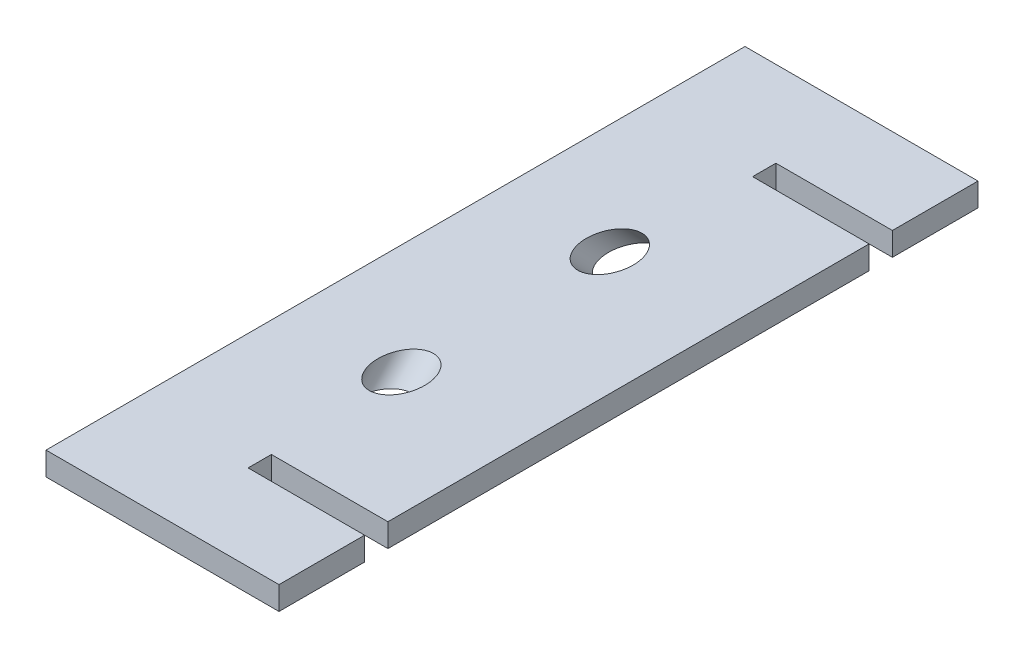
ISO-10303-21;
HEADER;
FILE_DESCRIPTION(('STEP AP214'),'2;1');
FILE_NAME('part.step','',(''),(''),'','','');
FILE_SCHEMA(('AUTOMOTIVE_DESIGN { 1 0 10303 214 1 1 1 1 }'));
ENDSEC;
DATA;
#1=APPLICATION_CONTEXT('core data for automotive mechanical design processes');
#2=APPLICATION_PROTOCOL_DEFINITION('international standard','automotive_design',2000,#1);
#3=PRODUCT_CONTEXT('',#1,'mechanical');
#4=PRODUCT('Part','Part','',(#3));
#5=PRODUCT_RELATED_PRODUCT_CATEGORY('part','',(#4));
#6=PRODUCT_DEFINITION_FORMATION('','',#4);
#7=PRODUCT_DEFINITION_CONTEXT('part definition',#1,'design');
#8=PRODUCT_DEFINITION('design','',#6,#7);
#9=PRODUCT_DEFINITION_SHAPE('','',#8);
#10=(LENGTH_UNIT() NAMED_UNIT(*) SI_UNIT(.MILLI.,.METRE.));
#11=(NAMED_UNIT(*) PLANE_ANGLE_UNIT() SI_UNIT($,.RADIAN.));
#12=(NAMED_UNIT(*) SI_UNIT($,.STERADIAN.) SOLID_ANGLE_UNIT());
#13=UNCERTAINTY_MEASURE_WITH_UNIT(LENGTH_MEASURE(1.E-05),#10,'distance_accuracy_value','');
#14=(GEOMETRIC_REPRESENTATION_CONTEXT(3) GLOBAL_UNCERTAINTY_ASSIGNED_CONTEXT((#13)) GLOBAL_UNIT_ASSIGNED_CONTEXT((#10,
#11,#12)) REPRESENTATION_CONTEXT('',''));
#15=CARTESIAN_POINT('',(0.,0.,0.));
#16=DIRECTION('',(0.,0.,1.));
#17=DIRECTION('',(1.,0.,0.));
#18=AXIS2_PLACEMENT_3D('',#15,#16,#17);
#19=CARTESIAN_POINT('',(2540.,217.4,-190.5));
#20=DIRECTION('',(-1.,0.,0.));
#21=DIRECTION('',(0.,0.,1.));
#22=AXIS2_PLACEMENT_3D('',#19,#20,#21);
#23=PLANE('',#22);
#24=DIRECTION('',(0.,0.,1.));
#25=VECTOR('',#24,1.);
#26=CARTESIAN_POINT('',(2540.,230.1,-190.5));
#27=LINE('',#26,#25);
#28=CARTESIAN_POINT('',(2540.,230.1,-190.5));
#29=VERTEX_POINT('',#28);
#30=CARTESIAN_POINT('',(2540.,230.1,190.5));
#31=VERTEX_POINT('',#30);
#32=EDGE_CURVE('E122',#29,#31,#27,.T.);
#33=ORIENTED_EDGE('',*,*,#32,.F.);
#34=DIRECTION('',(0.,1.,0.));
#35=VECTOR('',#34,1.);
#36=CARTESIAN_POINT('',(2540.,217.4,-190.5));
#37=LINE('',#36,#35);
#38=CARTESIAN_POINT('',(2540.,217.4,-190.5));
#39=VERTEX_POINT('',#38);
#40=EDGE_CURVE('E117',#39,#29,#37,.T.);
#41=ORIENTED_EDGE('',*,*,#40,.F.);
#42=DIRECTION('',(0.,0.,1.));
#43=VECTOR('',#42,1.);
#44=CARTESIAN_POINT('',(2540.,217.4,-190.5));
#45=LINE('',#44,#43);
#46=CARTESIAN_POINT('',(2540.,217.4,190.5));
#47=VERTEX_POINT('',#46);
#48=EDGE_CURVE('E124',#39,#47,#45,.T.);
#49=ORIENTED_EDGE('',*,*,#48,.T.);
#50=DIRECTION('',(0.,1.,0.));
#51=VECTOR('',#50,1.);
#52=CARTESIAN_POINT('',(2540.,217.4,190.5));
#53=LINE('',#52,#51);
#54=EDGE_CURVE('E120',#47,#31,#53,.T.);
#55=ORIENTED_EDGE('',*,*,#54,.T.);
#56=EDGE_LOOP('',(#33,#41,#49,#55));
#57=FACE_BOUND('',#56,.T.);
#58=ADVANCED_FACE('F37',(#57),#23,.T.);
#59=CARTESIAN_POINT('',(2540.,217.4,-190.5));
#60=DIRECTION('',(0.,0.,-1.));
#61=DIRECTION('',(-1.,0.,0.));
#62=AXIS2_PLACEMENT_3D('',#59,#60,#61);
#63=PLANE('',#62);
#64=DIRECTION('',(-1.,0.,0.));
#65=VECTOR('',#64,1.);
#66=CARTESIAN_POINT('',(2540.,230.1,-190.5));
#67=LINE('',#66,#65);
#68=CARTESIAN_POINT('',(2667.,230.1,-190.5));
#69=VERTEX_POINT('',#68);
#70=EDGE_CURVE('E137',#69,#29,#67,.T.);
#71=ORIENTED_EDGE('',*,*,#70,.F.);
#72=DIRECTION('',(0.,1.,0.));
#73=VECTOR('',#72,1.);
#74=CARTESIAN_POINT('',(2667.,217.4,-190.5));
#75=LINE('',#74,#73);
#76=CARTESIAN_POINT('',(2667.,217.4,-190.5));
#77=VERTEX_POINT('',#76);
#78=EDGE_CURVE('E100',#77,#69,#75,.T.);
#79=ORIENTED_EDGE('',*,*,#78,.F.);
#80=DIRECTION('',(-1.,0.,0.));
#81=VECTOR('',#80,1.);
#82=CARTESIAN_POINT('',(2540.,217.4,-190.5));
#83=LINE('',#82,#81);
#84=EDGE_CURVE('E126',#77,#39,#83,.T.);
#85=ORIENTED_EDGE('',*,*,#84,.T.);
#86=ORIENTED_EDGE('',*,*,#40,.T.);
#87=EDGE_LOOP('',(#71,#79,#85,#86));
#88=FACE_BOUND('',#87,.T.);
#89=ADVANCED_FACE('F224',(#88),#63,.T.);
#90=CARTESIAN_POINT('',(2667.,217.4,-190.5));
#91=DIRECTION('',(1.,0.,0.));
#92=DIRECTION('',(0.,0.,-1.));
#93=AXIS2_PLACEMENT_3D('',#90,#91,#92);
#94=PLANE('',#93);
#95=DIRECTION('',(0.,0.,-1.));
#96=VECTOR('',#95,1.);
#97=CARTESIAN_POINT('',(2667.,230.1,-190.5));
#98=LINE('',#97,#96);
#99=CARTESIAN_POINT('',(2667.,230.1,-143.842086105115));
#100=VERTEX_POINT('',#99);
#101=EDGE_CURVE('E167',#100,#69,#98,.T.);
#102=ORIENTED_EDGE('',*,*,#101,.F.);
#103=DIRECTION('',(0.,1.,0.));
#104=VECTOR('',#103,1.);
#105=CARTESIAN_POINT('',(2667.,217.4,-143.842086105115));
#106=LINE('',#105,#104);
#107=CARTESIAN_POINT('',(2667.,217.4,-143.842086105115));
#108=VERTEX_POINT('',#107);
#109=EDGE_CURVE('E106',#108,#100,#106,.T.);
#110=ORIENTED_EDGE('',*,*,#109,.F.);
#111=DIRECTION('',(0.,0.,-1.));
#112=VECTOR('',#111,1.);
#113=CARTESIAN_POINT('',(2667.,217.4,-190.5));
#114=LINE('',#113,#112);
#115=EDGE_CURVE('E171',#108,#77,#114,.T.);
#116=ORIENTED_EDGE('',*,*,#115,.T.);
#117=ORIENTED_EDGE('',*,*,#78,.T.);
#118=EDGE_LOOP('',(#102,#110,#116,#117));
#119=FACE_BOUND('',#118,.T.);
#120=ADVANCED_FACE('F219',(#119),#94,.T.);
#121=CARTESIAN_POINT('',(2603.5,217.4,-143.842086105115));
#122=DIRECTION('',(0.,0.,1.));
#123=DIRECTION('',(1.,0.,0.));
#124=AXIS2_PLACEMENT_3D('',#121,#122,#123);
#125=PLANE('',#124);
#126=DIRECTION('',(1.,0.,0.));
#127=VECTOR('',#126,1.);
#128=CARTESIAN_POINT('',(2603.5,230.1,-143.842086105115));
#129=LINE('',#128,#127);
#130=CARTESIAN_POINT('',(2603.5,230.1,-143.842086105115));
#131=VERTEX_POINT('',#130);
#132=EDGE_CURVE('E164',#131,#100,#129,.T.);
#133=ORIENTED_EDGE('',*,*,#132,.F.);
#134=DIRECTION('',(0.,1.,0.));
#135=VECTOR('',#134,1.);
#136=CARTESIAN_POINT('',(2603.5,217.4,-143.842086105115));
#137=LINE('',#136,#135);
#138=CARTESIAN_POINT('',(2603.5,217.4,-143.842086105115));
#139=VERTEX_POINT('',#138);
#140=EDGE_CURVE('E176',#139,#131,#137,.T.);
#141=ORIENTED_EDGE('',*,*,#140,.F.);
#142=DIRECTION('',(1.,0.,0.));
#143=VECTOR('',#142,1.);
#144=CARTESIAN_POINT('',(2603.5,217.4,-143.842086105115));
#145=LINE('',#144,#143);
#146=EDGE_CURVE('E173',#139,#108,#145,.T.);
#147=ORIENTED_EDGE('',*,*,#146,.T.);
#148=ORIENTED_EDGE('',*,*,#109,.T.);
#149=EDGE_LOOP('',(#133,#141,#147,#148));
#150=FACE_BOUND('',#149,.T.);
#151=ADVANCED_FACE('F231',(#150),#125,.T.);
#152=CARTESIAN_POINT('',(2603.5,217.4,-131.142086105115));
#153=DIRECTION('',(1.,0.,0.));
#154=DIRECTION('',(0.,0.,-1.));
#155=AXIS2_PLACEMENT_3D('',#152,#153,#154);
#156=PLANE('',#155);
#157=DIRECTION('',(0.,0.,-1.));
#158=VECTOR('',#157,1.);
#159=CARTESIAN_POINT('',(2603.5,230.1,-131.142086105115));
#160=LINE('',#159,#158);
#161=CARTESIAN_POINT('',(2603.5,230.1,-131.142086105115));
#162=VERTEX_POINT('',#161);
#163=EDGE_CURVE('E161',#162,#131,#160,.T.);
#164=ORIENTED_EDGE('',*,*,#163,.F.);
#165=DIRECTION('',(0.,1.,0.));
#166=VECTOR('',#165,1.);
#167=CARTESIAN_POINT('',(2603.5,217.4,-131.142086105115));
#168=LINE('',#167,#166);
#169=CARTESIAN_POINT('',(2603.5,217.4,-131.142086105115));
#170=VERTEX_POINT('',#169);
#171=EDGE_CURVE('E179',#170,#162,#168,.T.);
#172=ORIENTED_EDGE('',*,*,#171,.F.);
#173=DIRECTION('',(0.,0.,-1.));
#174=VECTOR('',#173,1.);
#175=CARTESIAN_POINT('',(2603.5,217.4,-131.142086105115));
#176=LINE('',#175,#174);
#177=EDGE_CURVE('E175',#170,#139,#176,.T.);
#178=ORIENTED_EDGE('',*,*,#177,.T.);
#179=ORIENTED_EDGE('',*,*,#140,.T.);
#180=EDGE_LOOP('',(#164,#172,#178,#179));
#181=FACE_BOUND('',#180,.T.);
#182=ADVANCED_FACE('F239',(#181),#156,.T.);
#183=CARTESIAN_POINT('',(2667.,217.4,-131.142086105115));
#184=DIRECTION('',(0.,0.,-1.));
#185=DIRECTION('',(-1.,0.,0.));
#186=AXIS2_PLACEMENT_3D('',#183,#184,#185);
#187=PLANE('',#186);
#188=DIRECTION('',(-1.,0.,0.));
#189=VECTOR('',#188,1.);
#190=CARTESIAN_POINT('',(2667.,230.1,-131.142086105115));
#191=LINE('',#190,#189);
#192=CARTESIAN_POINT('',(2667.,230.1,-131.142086105115));
#193=VERTEX_POINT('',#192);
#194=EDGE_CURVE('E158',#193,#162,#191,.T.);
#195=ORIENTED_EDGE('',*,*,#194,.F.);
#196=DIRECTION('',(0.,1.,0.));
#197=VECTOR('',#196,1.);
#198=CARTESIAN_POINT('',(2667.,217.4,-131.142086105115));
#199=LINE('',#198,#197);
#200=CARTESIAN_POINT('',(2667.,217.4,-131.142086105115));
#201=VERTEX_POINT('',#200);
#202=EDGE_CURVE('E182',#201,#193,#199,.T.);
#203=ORIENTED_EDGE('',*,*,#202,.F.);
#204=DIRECTION('',(-1.,0.,0.));
#205=VECTOR('',#204,1.);
#206=CARTESIAN_POINT('',(2667.,217.4,-131.142086105115));
#207=LINE('',#206,#205);
#208=EDGE_CURVE('E178',#201,#170,#207,.T.);
#209=ORIENTED_EDGE('',*,*,#208,.T.);
#210=ORIENTED_EDGE('',*,*,#171,.T.);
#211=EDGE_LOOP('',(#195,#203,#209,#210));
#212=FACE_BOUND('',#211,.T.);
#213=ADVANCED_FACE('F243',(#212),#187,.T.);
#214=CARTESIAN_POINT('',(2667.,217.4,-131.142086105115));
#215=DIRECTION('',(1.,0.,0.));
#216=DIRECTION('',(0.,0.,-1.));
#217=AXIS2_PLACEMENT_3D('',#214,#215,#216);
#218=PLANE('',#217);
#219=DIRECTION('',(0.,0.,-1.));
#220=VECTOR('',#219,1.);
#221=CARTESIAN_POINT('',(2667.,230.1,-131.142086105115));
#222=LINE('',#221,#220);
#223=CARTESIAN_POINT('',(2667.,230.1,131.142086105115));
#224=VERTEX_POINT('',#223);
#225=EDGE_CURVE('E155',#224,#193,#222,.T.);
#226=ORIENTED_EDGE('',*,*,#225,.F.);
#227=DIRECTION('',(0.,1.,0.));
#228=VECTOR('',#227,1.);
#229=CARTESIAN_POINT('',(2667.,217.4,131.142086105115));
#230=LINE('',#229,#228);
#231=CARTESIAN_POINT('',(2667.,217.4,131.142086105115));
#232=VERTEX_POINT('',#231);
#233=EDGE_CURVE('E185',#232,#224,#230,.T.);
#234=ORIENTED_EDGE('',*,*,#233,.F.);
#235=DIRECTION('',(0.,0.,-1.));
#236=VECTOR('',#235,1.);
#237=CARTESIAN_POINT('',(2667.,217.4,-131.142086105115));
#238=LINE('',#237,#236);
#239=EDGE_CURVE('E181',#232,#201,#238,.T.);
#240=ORIENTED_EDGE('',*,*,#239,.T.);
#241=ORIENTED_EDGE('',*,*,#202,.T.);
#242=EDGE_LOOP('',(#226,#234,#240,#241));
#243=FACE_BOUND('',#242,.T.);
#244=ADVANCED_FACE('F247',(#243),#218,.T.);
#245=CARTESIAN_POINT('',(2603.5,217.4,131.142086105115));
#246=DIRECTION('',(0.,0.,1.));
#247=DIRECTION('',(1.,0.,0.));
#248=AXIS2_PLACEMENT_3D('',#245,#246,#247);
#249=PLANE('',#248);
#250=DIRECTION('',(1.,0.,0.));
#251=VECTOR('',#250,1.);
#252=CARTESIAN_POINT('',(2603.5,230.1,131.142086105115));
#253=LINE('',#252,#251);
#254=CARTESIAN_POINT('',(2603.5,230.1,131.142086105115));
#255=VERTEX_POINT('',#254);
#256=EDGE_CURVE('E152',#255,#224,#253,.T.);
#257=ORIENTED_EDGE('',*,*,#256,.F.);
#258=DIRECTION('',(0.,1.,0.));
#259=VECTOR('',#258,1.);
#260=CARTESIAN_POINT('',(2603.5,217.4,131.142086105115));
#261=LINE('',#260,#259);
#262=CARTESIAN_POINT('',(2603.5,217.4,131.142086105115));
#263=VERTEX_POINT('',#262);
#264=EDGE_CURVE('E188',#263,#255,#261,.T.);
#265=ORIENTED_EDGE('',*,*,#264,.F.);
#266=DIRECTION('',(1.,0.,0.));
#267=VECTOR('',#266,1.);
#268=CARTESIAN_POINT('',(2603.5,217.4,131.142086105115));
#269=LINE('',#268,#267);
#270=EDGE_CURVE('E184',#263,#232,#269,.T.);
#271=ORIENTED_EDGE('',*,*,#270,.T.);
#272=ORIENTED_EDGE('',*,*,#233,.T.);
#273=EDGE_LOOP('',(#257,#265,#271,#272));
#274=FACE_BOUND('',#273,.T.);
#275=ADVANCED_FACE('F251',(#274),#249,.T.);
#276=CARTESIAN_POINT('',(2603.5,217.4,143.842086105115));
#277=DIRECTION('',(1.,0.,0.));
#278=DIRECTION('',(0.,0.,-1.));
#279=AXIS2_PLACEMENT_3D('',#276,#277,#278);
#280=PLANE('',#279);
#281=DIRECTION('',(0.,0.,-1.));
#282=VECTOR('',#281,1.);
#283=CARTESIAN_POINT('',(2603.5,230.1,143.842086105115));
#284=LINE('',#283,#282);
#285=CARTESIAN_POINT('',(2603.5,230.1,143.842086105115));
#286=VERTEX_POINT('',#285);
#287=EDGE_CURVE('E149',#286,#255,#284,.T.);
#288=ORIENTED_EDGE('',*,*,#287,.F.);
#289=DIRECTION('',(0.,1.,0.));
#290=VECTOR('',#289,1.);
#291=CARTESIAN_POINT('',(2603.5,217.4,143.842086105115));
#292=LINE('',#291,#290);
#293=CARTESIAN_POINT('',(2603.5,217.4,143.842086105115));
#294=VERTEX_POINT('',#293);
#295=EDGE_CURVE('E191',#294,#286,#292,.T.);
#296=ORIENTED_EDGE('',*,*,#295,.F.);
#297=DIRECTION('',(0.,0.,-1.));
#298=VECTOR('',#297,1.);
#299=CARTESIAN_POINT('',(2603.5,217.4,143.842086105115));
#300=LINE('',#299,#298);
#301=EDGE_CURVE('E187',#294,#263,#300,.T.);
#302=ORIENTED_EDGE('',*,*,#301,.T.);
#303=ORIENTED_EDGE('',*,*,#264,.T.);
#304=EDGE_LOOP('',(#288,#296,#302,#303));
#305=FACE_BOUND('',#304,.T.);
#306=ADVANCED_FACE('F255',(#305),#280,.T.);
#307=CARTESIAN_POINT('',(2667.,217.4,143.842086105115));
#308=DIRECTION('',(0.,0.,-1.));
#309=DIRECTION('',(-1.,0.,0.));
#310=AXIS2_PLACEMENT_3D('',#307,#308,#309);
#311=PLANE('',#310);
#312=DIRECTION('',(-1.,0.,0.));
#313=VECTOR('',#312,1.);
#314=CARTESIAN_POINT('',(2667.,230.1,143.842086105115));
#315=LINE('',#314,#313);
#316=CARTESIAN_POINT('',(2667.,230.1,143.842086105115));
#317=VERTEX_POINT('',#316);
#318=EDGE_CURVE('E146',#317,#286,#315,.T.);
#319=ORIENTED_EDGE('',*,*,#318,.F.);
#320=DIRECTION('',(0.,1.,0.));
#321=VECTOR('',#320,1.);
#322=CARTESIAN_POINT('',(2667.,217.4,143.842086105115));
#323=LINE('',#322,#321);
#324=CARTESIAN_POINT('',(2667.,217.4,143.842086105115));
#325=VERTEX_POINT('',#324);
#326=EDGE_CURVE('E194',#325,#317,#323,.T.);
#327=ORIENTED_EDGE('',*,*,#326,.F.);
#328=DIRECTION('',(-1.,0.,0.));
#329=VECTOR('',#328,1.);
#330=CARTESIAN_POINT('',(2667.,217.4,143.842086105115));
#331=LINE('',#330,#329);
#332=EDGE_CURVE('E190',#325,#294,#331,.T.);
#333=ORIENTED_EDGE('',*,*,#332,.T.);
#334=ORIENTED_EDGE('',*,*,#295,.T.);
#335=EDGE_LOOP('',(#319,#327,#333,#334));
#336=FACE_BOUND('',#335,.T.);
#337=ADVANCED_FACE('F259',(#336),#311,.T.);
#338=CARTESIAN_POINT('',(2667.,217.4,143.842086105115));
#339=DIRECTION('',(1.,0.,0.));
#340=DIRECTION('',(0.,0.,-1.));
#341=AXIS2_PLACEMENT_3D('',#338,#339,#340);
#342=PLANE('',#341);
#343=DIRECTION('',(0.,0.,-1.));
#344=VECTOR('',#343,1.);
#345=CARTESIAN_POINT('',(2667.,230.1,143.842086105115));
#346=LINE('',#345,#344);
#347=CARTESIAN_POINT('',(2667.,230.1,190.5));
#348=VERTEX_POINT('',#347);
#349=EDGE_CURVE('E133',#348,#317,#346,.T.);
#350=ORIENTED_EDGE('',*,*,#349,.F.);
#351=DIRECTION('',(0.,1.,0.));
#352=VECTOR('',#351,1.);
#353=CARTESIAN_POINT('',(2667.,217.4,190.5));
#354=LINE('',#353,#352);
#355=CARTESIAN_POINT('',(2667.,217.4,190.5));
#356=VERTEX_POINT('',#355);
#357=EDGE_CURVE('E54',#356,#348,#354,.T.);
#358=ORIENTED_EDGE('',*,*,#357,.F.);
#359=DIRECTION('',(0.,0.,-1.));
#360=VECTOR('',#359,1.);
#361=CARTESIAN_POINT('',(2667.,217.4,143.842086105115));
#362=LINE('',#361,#360);
#363=EDGE_CURVE('E193',#356,#325,#362,.T.);
#364=ORIENTED_EDGE('',*,*,#363,.T.);
#365=ORIENTED_EDGE('',*,*,#326,.T.);
#366=EDGE_LOOP('',(#350,#358,#364,#365));
#367=FACE_BOUND('',#366,.T.);
#368=ADVANCED_FACE('F263',(#367),#342,.T.);
#369=CARTESIAN_POINT('',(2540.,217.4,190.5));
#370=DIRECTION('',(0.,0.,1.));
#371=DIRECTION('',(1.,0.,0.));
#372=AXIS2_PLACEMENT_3D('',#369,#370,#371);
#373=PLANE('',#372);
#374=DIRECTION('',(1.,0.,0.));
#375=VECTOR('',#374,1.);
#376=CARTESIAN_POINT('',(2540.,230.1,190.5));
#377=LINE('',#376,#375);
#378=EDGE_CURVE('E129',#31,#348,#377,.T.);
#379=ORIENTED_EDGE('',*,*,#378,.F.);
#380=ORIENTED_EDGE('',*,*,#54,.F.);
#381=DIRECTION('',(1.,0.,0.));
#382=VECTOR('',#381,1.);
#383=CARTESIAN_POINT('',(2540.,217.4,190.5));
#384=LINE('',#383,#382);
#385=EDGE_CURVE('E196',#47,#356,#384,.T.);
#386=ORIENTED_EDGE('',*,*,#385,.T.);
#387=ORIENTED_EDGE('',*,*,#357,.T.);
#388=EDGE_LOOP('',(#379,#380,#386,#387));
#389=FACE_BOUND('',#388,.T.);
#390=ADVANCED_FACE('F130',(#389),#373,.T.);
#391=CARTESIAN_POINT('',(0.,217.4,0.));
#392=DIRECTION('',(0.,1.,0.));
#393=DIRECTION('',(0.,0.,1.));
#394=AXIS2_PLACEMENT_3D('',#391,#392,#393);
#395=PLANE('',#394);
#396=CARTESIAN_POINT('',(2599.99999999996,217.4,-68.8448275862046));
#397=DIRECTION('',(0.,1.,0.));
#398=DIRECTION('',(0.,0.,1.));
#399=AXIS2_PLACEMENT_3D('',#396,#397,#398);
#400=ELLIPSE('',#399,17.5021810259714,12.6999999999999);
#401=CARTESIAN_POINT('',(2599.99999999996,217.4,-51.3426465602332));
#402=VERTEX_POINT('',#401);
#403=EDGE_CURVE('E11',#402,#402,#400,.F.);
#404=ORIENTED_EDGE('',*,*,#403,.F.);
#405=EDGE_LOOP('',(#404));
#406=FACE_BOUND('',#405,.T.);
#407=CARTESIAN_POINT('',(2599.99999999996,217.4,68.8448275862026));
#408=DIRECTION('',(0.,1.,0.));
#409=DIRECTION('',(0.,0.,1.));
#410=AXIS2_PLACEMENT_3D('',#407,#408,#409);
#411=ELLIPSE('',#410,17.5021810259713,12.6999999999999);
#412=CARTESIAN_POINT('',(2599.99999999996,217.4,86.3470086121739));
#413=VERTEX_POINT('',#412);
#414=EDGE_CURVE('E46',#413,#413,#411,.F.);
#415=ORIENTED_EDGE('',*,*,#414,.F.);
#416=EDGE_LOOP('',(#415));
#417=FACE_BOUND('',#416,.T.);
#418=ORIENTED_EDGE('',*,*,#48,.F.);
#419=ORIENTED_EDGE('',*,*,#84,.F.);
#420=ORIENTED_EDGE('',*,*,#115,.F.);
#421=ORIENTED_EDGE('',*,*,#146,.F.);
#422=ORIENTED_EDGE('',*,*,#177,.F.);
#423=ORIENTED_EDGE('',*,*,#208,.F.);
#424=ORIENTED_EDGE('',*,*,#239,.F.);
#425=ORIENTED_EDGE('',*,*,#270,.F.);
#426=ORIENTED_EDGE('',*,*,#301,.F.);
#427=ORIENTED_EDGE('',*,*,#332,.F.);
#428=ORIENTED_EDGE('',*,*,#363,.F.);
#429=ORIENTED_EDGE('',*,*,#385,.F.);
#430=EDGE_LOOP('',(#418,#419,#420,#421,#422,#423,#424,#425,#426,#427,#428,#429));
#431=FACE_BOUND('',#430,.T.);
#432=ADVANCED_FACE('F39',(#406,#417,#431),#395,.F.);
#433=CARTESIAN_POINT('',(0.,230.1,0.));
#434=DIRECTION('',(0.,1.,0.));
#435=DIRECTION('',(0.,0.,1.));
#436=AXIS2_PLACEMENT_3D('',#433,#434,#435);
#437=PLANE('',#436);
#438=CARTESIAN_POINT('',(2599.99999999996,230.1,-56.8017241379285));
#439=DIRECTION('',(0.,1.,0.));
#440=DIRECTION('',(0.,0.,1.));
#441=AXIS2_PLACEMENT_3D('',#438,#439,#440);
#442=ELLIPSE('',#441,17.5021810259714,12.6999999999999);
#443=CARTESIAN_POINT('',(2599.99999999996,230.1,-39.2995431119571));
#444=VERTEX_POINT('',#443);
#445=EDGE_CURVE('E141',#444,#444,#442,.F.);
#446=ORIENTED_EDGE('',*,*,#445,.T.);
#447=EDGE_LOOP('',(#446));
#448=FACE_BOUND('',#447,.T.);
#449=CARTESIAN_POINT('',(2599.99999999996,230.1,56.8017241379268));
#450=DIRECTION('',(0.,1.,0.));
#451=DIRECTION('',(0.,0.,1.));
#452=AXIS2_PLACEMENT_3D('',#449,#450,#451);
#453=ELLIPSE('',#452,17.5021810259713,12.6999999999999);
#454=CARTESIAN_POINT('',(2599.99999999996,230.1,74.303905163898));
#455=VERTEX_POINT('',#454);
#456=EDGE_CURVE('E138',#455,#455,#453,.F.);
#457=ORIENTED_EDGE('',*,*,#456,.T.);
#458=EDGE_LOOP('',(#457));
#459=FACE_BOUND('',#458,.T.);
#460=ORIENTED_EDGE('',*,*,#32,.T.);
#461=ORIENTED_EDGE('',*,*,#378,.T.);
#462=ORIENTED_EDGE('',*,*,#349,.T.);
#463=ORIENTED_EDGE('',*,*,#318,.T.);
#464=ORIENTED_EDGE('',*,*,#287,.T.);
#465=ORIENTED_EDGE('',*,*,#256,.T.);
#466=ORIENTED_EDGE('',*,*,#225,.T.);
#467=ORIENTED_EDGE('',*,*,#194,.T.);
#468=ORIENTED_EDGE('',*,*,#163,.T.);
#469=ORIENTED_EDGE('',*,*,#132,.T.);
#470=ORIENTED_EDGE('',*,*,#101,.T.);
#471=ORIENTED_EDGE('',*,*,#70,.T.);
#472=EDGE_LOOP('',(#460,#461,#462,#463,#464,#465,#466,#467,#468,#469,#470,#471));
#473=FACE_BOUND('',#472,.T.);
#474=ADVANCED_FACE('F135',(#448,#459,#473),#437,.T.);
#475=CARTESIAN_POINT('',(2599.99999999996,289.999999999996,-4.44089209850063E-13));
#476=DIRECTION('',(0.,-0.725623851173434,0.688091583009292));
#477=DIRECTION('',(0.,-0.688091583009292,-0.725623851173434));
#478=AXIS2_PLACEMENT_3D('',#475,#476,#477);
#479=CYLINDRICAL_SURFACE('',#478,12.6999999999999);
#480=ORIENTED_EDGE('',*,*,#456,.F.);
#481=EDGE_LOOP('',(#480));
#482=FACE_BOUND('',#481,.T.);
#483=ORIENTED_EDGE('',*,*,#414,.T.);
#484=EDGE_LOOP('',(#483));
#485=FACE_BOUND('',#484,.T.);
#486=ADVANCED_FACE('F235',(#482,#485),#479,.F.);
#487=CARTESIAN_POINT('',(2599.99999999996,0.,-275.000000000001));
#488=DIRECTION('',(0.,0.725623851173429,0.688091583009297));
#489=DIRECTION('',(0.,-0.688091583009297,0.725623851173429));
#490=AXIS2_PLACEMENT_3D('',#487,#488,#489);
#491=CYLINDRICAL_SURFACE('',#490,12.6999999999999);
#492=ORIENTED_EDGE('',*,*,#445,.F.);
#493=EDGE_LOOP('',(#492));
#494=FACE_BOUND('',#493,.T.);
#495=ORIENTED_EDGE('',*,*,#403,.T.);
#496=EDGE_LOOP('',(#495));
#497=FACE_BOUND('',#496,.T.);
#498=ADVANCED_FACE('F270',(#494,#497),#491,.F.);
#499=CLOSED_SHELL('',(#58,#89,#120,#151,#182,#213,#244,#275,#306,#337,#368,#390,#432,#474,#486,#498));
#500=MANIFOLD_SOLID_BREP('B2',#499);
#501=ADVANCED_BREP_SHAPE_REPRESENTATION('',(#18,#500),#14);
#502=SHAPE_DEFINITION_REPRESENTATION(#9,#501);
ENDSEC;
END-ISO-10303-21;
